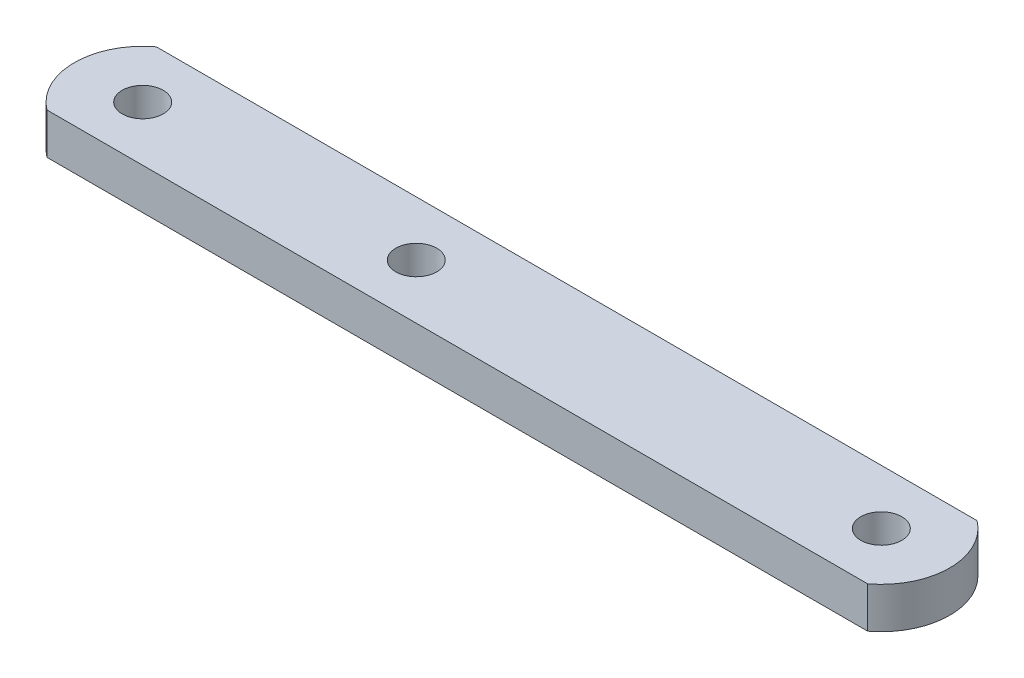
ISO-10303-21;
HEADER;
FILE_DESCRIPTION(('STEP AP214'),'2;1');
FILE_NAME('part.step','',(''),(''),'','','');
FILE_SCHEMA(('AUTOMOTIVE_DESIGN { 1 0 10303 214 1 1 1 1 }'));
ENDSEC;
DATA;
#1=APPLICATION_CONTEXT('core data for automotive mechanical design processes');
#2=APPLICATION_PROTOCOL_DEFINITION('international standard','automotive_design',2000,#1);
#3=PRODUCT_CONTEXT('',#1,'mechanical');
#4=PRODUCT('Part','Part','',(#3));
#5=PRODUCT_RELATED_PRODUCT_CATEGORY('part','',(#4));
#6=PRODUCT_DEFINITION_FORMATION('','',#4);
#7=PRODUCT_DEFINITION_CONTEXT('part definition',#1,'design');
#8=PRODUCT_DEFINITION('design','',#6,#7);
#9=PRODUCT_DEFINITION_SHAPE('','',#8);
#10=(LENGTH_UNIT() NAMED_UNIT(*) SI_UNIT(.MILLI.,.METRE.));
#11=(NAMED_UNIT(*) PLANE_ANGLE_UNIT() SI_UNIT($,.RADIAN.));
#12=(NAMED_UNIT(*) SI_UNIT($,.STERADIAN.) SOLID_ANGLE_UNIT());
#13=UNCERTAINTY_MEASURE_WITH_UNIT(LENGTH_MEASURE(1.E-05),#10,'distance_accuracy_value','');
#14=(GEOMETRIC_REPRESENTATION_CONTEXT(3) GLOBAL_UNCERTAINTY_ASSIGNED_CONTEXT((#13)) GLOBAL_UNIT_ASSIGNED_CONTEXT((#10,
#11,#12)) REPRESENTATION_CONTEXT('',''));
#15=CARTESIAN_POINT('',(0.,0.,0.));
#16=DIRECTION('',(0.,0.,1.));
#17=DIRECTION('',(1.,0.,0.));
#18=AXIS2_PLACEMENT_3D('',#15,#16,#17);
#19=CARTESIAN_POINT('',(-3.,3.,-4.));
#20=DIRECTION('',(0.,-1.,0.));
#21=DIRECTION('',(0.,0.,-1.));
#22=AXIS2_PLACEMENT_3D('',#19,#20,#21);
#23=PLANE('',#22);
#24=CARTESIAN_POINT('',(-3.,3.,-4.));
#25=DIRECTION('',(0.,1.,0.));
#26=DIRECTION('',(0.,0.,-1.));
#27=AXIS2_PLACEMENT_3D('',#24,#25,#26);
#28=CIRCLE('',#27,5.);
#29=CARTESIAN_POINT('',(0.,3.,0.));
#30=VERTEX_POINT('',#29);
#31=CARTESIAN_POINT('',(0.,3.,-8.));
#32=VERTEX_POINT('',#31);
#33=EDGE_CURVE('E85',#30,#32,#28,.T.);
#34=ORIENTED_EDGE('',*,*,#33,.T.);
#35=DIRECTION('',(-1.,0.,0.));
#36=VECTOR('',#35,1.);
#37=CARTESIAN_POINT('',(0.,3.,-8.));
#38=LINE('',#37,#36);
#39=CARTESIAN_POINT('',(-60.,3.,-7.99999999999999));
#40=VERTEX_POINT('',#39);
#41=EDGE_CURVE('E80',#32,#40,#38,.T.);
#42=ORIENTED_EDGE('',*,*,#41,.T.);
#43=CARTESIAN_POINT('',(-57.,3.,-3.99999999999999));
#44=DIRECTION('',(0.,1.,0.));
#45=DIRECTION('',(0.,0.,1.));
#46=AXIS2_PLACEMENT_3D('',#43,#44,#45);
#47=CIRCLE('',#46,5.);
#48=CARTESIAN_POINT('',(-60.,3.,0.));
#49=VERTEX_POINT('',#48);
#50=EDGE_CURVE('E83',#40,#49,#47,.T.);
#51=ORIENTED_EDGE('',*,*,#50,.T.);
#52=DIRECTION('',(1.,0.,0.));
#53=VECTOR('',#52,1.);
#54=CARTESIAN_POINT('',(0.,3.,0.));
#55=LINE('',#54,#53);
#56=EDGE_CURVE('E50',#49,#30,#55,.T.);
#57=ORIENTED_EDGE('',*,*,#56,.T.);
#58=EDGE_LOOP('',(#34,#42,#51,#57));
#59=FACE_BOUND('',#58,.T.);
#60=CARTESIAN_POINT('',(-57.,3.,-3.99999999999999));
#61=DIRECTION('',(0.,1.,0.));
#62=DIRECTION('',(0.,0.,1.));
#63=AXIS2_PLACEMENT_3D('',#60,#61,#62);
#64=CIRCLE('',#63,1.5);
#65=CARTESIAN_POINT('',(-57.,3.,-2.49999999999999));
#66=VERTEX_POINT('',#65);
#67=EDGE_CURVE('E100',#66,#66,#64,.T.);
#68=ORIENTED_EDGE('',*,*,#67,.F.);
#69=EDGE_LOOP('',(#68));
#70=FACE_BOUND('',#69,.T.);
#71=CARTESIAN_POINT('',(-3.,3.,-4.));
#72=DIRECTION('',(0.,1.,0.));
#73=DIRECTION('',(0.,0.,-1.));
#74=AXIS2_PLACEMENT_3D('',#71,#72,#73);
#75=CIRCLE('',#74,1.5);
#76=CARTESIAN_POINT('',(-3.,3.,-5.5));
#77=VERTEX_POINT('',#76);
#78=EDGE_CURVE('E115',#77,#77,#75,.T.);
#79=ORIENTED_EDGE('',*,*,#78,.F.);
#80=EDGE_LOOP('',(#79));
#81=FACE_BOUND('',#80,.T.);
#82=CARTESIAN_POINT('',(-37.,3.,-3.99999999999999));
#83=DIRECTION('',(0.,1.,0.));
#84=DIRECTION('',(0.,0.,1.));
#85=AXIS2_PLACEMENT_3D('',#82,#83,#84);
#86=CIRCLE('',#85,1.5);
#87=CARTESIAN_POINT('',(-37.,3.,-2.49999999999999));
#88=VERTEX_POINT('',#87);
#89=EDGE_CURVE('E121',#88,#88,#86,.T.);
#90=ORIENTED_EDGE('',*,*,#89,.F.);
#91=EDGE_LOOP('',(#90));
#92=FACE_BOUND('',#91,.T.);
#93=ADVANCED_FACE('F33',(#59,#70,#81,#92),#23,.F.);
#94=CARTESIAN_POINT('',(-3.,0.,-4.));
#95=DIRECTION('',(0.,-1.,0.));
#96=DIRECTION('',(0.,0.,-1.));
#97=AXIS2_PLACEMENT_3D('',#94,#95,#96);
#98=PLANE('',#97);
#99=CARTESIAN_POINT('',(-3.,0.,-4.));
#100=DIRECTION('',(0.,1.,0.));
#101=DIRECTION('',(0.,0.,-1.));
#102=AXIS2_PLACEMENT_3D('',#99,#100,#101);
#103=CIRCLE('',#102,1.5);
#104=CARTESIAN_POINT('',(-3.,0.,-5.5));
#105=VERTEX_POINT('',#104);
#106=EDGE_CURVE('E118',#105,#105,#103,.T.);
#107=ORIENTED_EDGE('',*,*,#106,.T.);
#108=EDGE_LOOP('',(#107));
#109=FACE_BOUND('',#108,.T.);
#110=CARTESIAN_POINT('',(-3.,0.,-4.));
#111=DIRECTION('',(0.,1.,0.));
#112=DIRECTION('',(0.,0.,-1.));
#113=AXIS2_PLACEMENT_3D('',#110,#111,#112);
#114=CIRCLE('',#113,5.);
#115=CARTESIAN_POINT('',(0.,0.,0.));
#116=VERTEX_POINT('',#115);
#117=CARTESIAN_POINT('',(0.,0.,-8.));
#118=VERTEX_POINT('',#117);
#119=EDGE_CURVE('E97',#116,#118,#114,.T.);
#120=ORIENTED_EDGE('',*,*,#119,.F.);
#121=DIRECTION('',(1.,0.,0.));
#122=VECTOR('',#121,1.);
#123=CARTESIAN_POINT('',(0.,0.,0.));
#124=LINE('',#123,#122);
#125=CARTESIAN_POINT('',(-60.,0.,0.));
#126=VERTEX_POINT('',#125);
#127=EDGE_CURVE('E73',#126,#116,#124,.T.);
#128=ORIENTED_EDGE('',*,*,#127,.F.);
#129=CARTESIAN_POINT('',(-57.,0.,-3.99999999999999));
#130=DIRECTION('',(0.,1.,0.));
#131=DIRECTION('',(0.,0.,1.));
#132=AXIS2_PLACEMENT_3D('',#129,#130,#131);
#133=CIRCLE('',#132,5.);
#134=CARTESIAN_POINT('',(-60.,0.,-7.99999999999999));
#135=VERTEX_POINT('',#134);
#136=EDGE_CURVE('E67',#135,#126,#133,.T.);
#137=ORIENTED_EDGE('',*,*,#136,.F.);
#138=DIRECTION('',(-1.,0.,0.));
#139=VECTOR('',#138,1.);
#140=CARTESIAN_POINT('',(0.,0.,-8.));
#141=LINE('',#140,#139);
#142=EDGE_CURVE('E89',#118,#135,#141,.T.);
#143=ORIENTED_EDGE('',*,*,#142,.F.);
#144=EDGE_LOOP('',(#120,#128,#137,#143));
#145=FACE_BOUND('',#144,.T.);
#146=CARTESIAN_POINT('',(-57.,0.,-3.99999999999999));
#147=DIRECTION('',(0.,1.,0.));
#148=DIRECTION('',(0.,0.,1.));
#149=AXIS2_PLACEMENT_3D('',#146,#147,#148);
#150=CIRCLE('',#149,1.5);
#151=CARTESIAN_POINT('',(-57.,0.,-2.49999999999999));
#152=VERTEX_POINT('',#151);
#153=EDGE_CURVE('E112',#152,#152,#150,.T.);
#154=ORIENTED_EDGE('',*,*,#153,.T.);
#155=EDGE_LOOP('',(#154));
#156=FACE_BOUND('',#155,.T.);
#157=CARTESIAN_POINT('',(-37.,0.,-3.99999999999999));
#158=DIRECTION('',(0.,1.,0.));
#159=DIRECTION('',(0.,0.,1.));
#160=AXIS2_PLACEMENT_3D('',#157,#158,#159);
#161=CIRCLE('',#160,1.5);
#162=CARTESIAN_POINT('',(-37.,0.,-2.49999999999999));
#163=VERTEX_POINT('',#162);
#164=EDGE_CURVE('E124',#163,#163,#161,.T.);
#165=ORIENTED_EDGE('',*,*,#164,.T.);
#166=EDGE_LOOP('',(#165));
#167=FACE_BOUND('',#166,.T.);
#168=ADVANCED_FACE('F108',(#109,#145,#156,#167),#98,.T.);
#169=CARTESIAN_POINT('',(-3.,3.,-4.));
#170=DIRECTION('',(0.,-1.,0.));
#171=DIRECTION('',(0.,0.,-1.));
#172=AXIS2_PLACEMENT_3D('',#169,#170,#171);
#173=CYLINDRICAL_SURFACE('',#172,5.);
#174=ORIENTED_EDGE('',*,*,#119,.T.);
#175=DIRECTION('',(0.,-1.,0.));
#176=VECTOR('',#175,1.);
#177=CARTESIAN_POINT('',(0.,3.,-8.));
#178=LINE('',#177,#176);
#179=EDGE_CURVE('E11',#32,#118,#178,.T.);
#180=ORIENTED_EDGE('',*,*,#179,.F.);
#181=ORIENTED_EDGE('',*,*,#33,.F.);
#182=DIRECTION('',(0.,-1.,0.));
#183=VECTOR('',#182,1.);
#184=CARTESIAN_POINT('',(0.,3.,0.));
#185=LINE('',#184,#183);
#186=EDGE_CURVE('E93',#30,#116,#185,.T.);
#187=ORIENTED_EDGE('',*,*,#186,.T.);
#188=EDGE_LOOP('',(#174,#180,#181,#187));
#189=FACE_BOUND('',#188,.T.);
#190=ADVANCED_FACE('F35',(#189),#173,.T.);
#191=CARTESIAN_POINT('',(0.,3.,-8.));
#192=DIRECTION('',(0.,0.,1.));
#193=DIRECTION('',(1.,0.,0.));
#194=AXIS2_PLACEMENT_3D('',#191,#192,#193);
#195=PLANE('',#194);
#196=ORIENTED_EDGE('',*,*,#142,.T.);
#197=DIRECTION('',(0.,-1.,0.));
#198=VECTOR('',#197,1.);
#199=CARTESIAN_POINT('',(-60.,3.,-7.99999999999999));
#200=LINE('',#199,#198);
#201=EDGE_CURVE('E42',#40,#135,#200,.T.);
#202=ORIENTED_EDGE('',*,*,#201,.F.);
#203=ORIENTED_EDGE('',*,*,#41,.F.);
#204=ORIENTED_EDGE('',*,*,#179,.T.);
#205=EDGE_LOOP('',(#196,#202,#203,#204));
#206=FACE_BOUND('',#205,.T.);
#207=ADVANCED_FACE('F88',(#206),#195,.F.);
#208=CARTESIAN_POINT('',(-57.,3.,-3.99999999999999));
#209=DIRECTION('',(0.,-1.,0.));
#210=DIRECTION('',(0.,0.,-1.));
#211=AXIS2_PLACEMENT_3D('',#208,#209,#210);
#212=CYLINDRICAL_SURFACE('',#211,5.);
#213=ORIENTED_EDGE('',*,*,#136,.T.);
#214=DIRECTION('',(0.,-1.,0.));
#215=VECTOR('',#214,1.);
#216=CARTESIAN_POINT('',(-60.,3.,0.));
#217=LINE('',#216,#215);
#218=EDGE_CURVE('E90',#49,#126,#217,.T.);
#219=ORIENTED_EDGE('',*,*,#218,.F.);
#220=ORIENTED_EDGE('',*,*,#50,.F.);
#221=ORIENTED_EDGE('',*,*,#201,.T.);
#222=EDGE_LOOP('',(#213,#219,#220,#221));
#223=FACE_BOUND('',#222,.T.);
#224=ADVANCED_FACE('F91',(#223),#212,.T.);
#225=CARTESIAN_POINT('',(0.,3.,0.));
#226=DIRECTION('',(0.,0.,-1.));
#227=DIRECTION('',(-1.,0.,0.));
#228=AXIS2_PLACEMENT_3D('',#225,#226,#227);
#229=PLANE('',#228);
#230=ORIENTED_EDGE('',*,*,#127,.T.);
#231=ORIENTED_EDGE('',*,*,#186,.F.);
#232=ORIENTED_EDGE('',*,*,#56,.F.);
#233=ORIENTED_EDGE('',*,*,#218,.T.);
#234=EDGE_LOOP('',(#230,#231,#232,#233));
#235=FACE_BOUND('',#234,.T.);
#236=ADVANCED_FACE('F105',(#235),#229,.F.);
#237=CARTESIAN_POINT('',(-57.,3.,-3.99999999999999));
#238=DIRECTION('',(0.,-1.,0.));
#239=DIRECTION('',(0.,0.,-1.));
#240=AXIS2_PLACEMENT_3D('',#237,#238,#239);
#241=CYLINDRICAL_SURFACE('',#240,1.5);
#242=ORIENTED_EDGE('',*,*,#67,.T.);
#243=EDGE_LOOP('',(#242));
#244=FACE_BOUND('',#243,.T.);
#245=ORIENTED_EDGE('',*,*,#153,.F.);
#246=EDGE_LOOP('',(#245));
#247=FACE_BOUND('',#246,.T.);
#248=ADVANCED_FACE('F141',(#244,#247),#241,.F.);
#249=CARTESIAN_POINT('',(-3.,3.,-4.));
#250=DIRECTION('',(0.,-1.,0.));
#251=DIRECTION('',(0.,0.,-1.));
#252=AXIS2_PLACEMENT_3D('',#249,#250,#251);
#253=CYLINDRICAL_SURFACE('',#252,1.5);
#254=ORIENTED_EDGE('',*,*,#78,.T.);
#255=EDGE_LOOP('',(#254));
#256=FACE_BOUND('',#255,.T.);
#257=ORIENTED_EDGE('',*,*,#106,.F.);
#258=EDGE_LOOP('',(#257));
#259=FACE_BOUND('',#258,.T.);
#260=ADVANCED_FACE('F187',(#256,#259),#253,.F.);
#261=CARTESIAN_POINT('',(-37.,3.,-3.99999999999999));
#262=DIRECTION('',(0.,-1.,0.));
#263=DIRECTION('',(0.,0.,-1.));
#264=AXIS2_PLACEMENT_3D('',#261,#262,#263);
#265=CYLINDRICAL_SURFACE('',#264,1.5);
#266=ORIENTED_EDGE('',*,*,#89,.T.);
#267=EDGE_LOOP('',(#266));
#268=FACE_BOUND('',#267,.T.);
#269=ORIENTED_EDGE('',*,*,#164,.F.);
#270=EDGE_LOOP('',(#269));
#271=FACE_BOUND('',#270,.T.);
#272=ADVANCED_FACE('F130',(#268,#271),#265,.F.);
#273=CLOSED_SHELL('',(#93,#168,#190,#207,#224,#236,#248,#260,#272));
#274=MANIFOLD_SOLID_BREP('B2',#273);
#275=ADVANCED_BREP_SHAPE_REPRESENTATION('',(#18,#274),#14);
#276=SHAPE_DEFINITION_REPRESENTATION(#9,#275);
ENDSEC;
END-ISO-10303-21;
